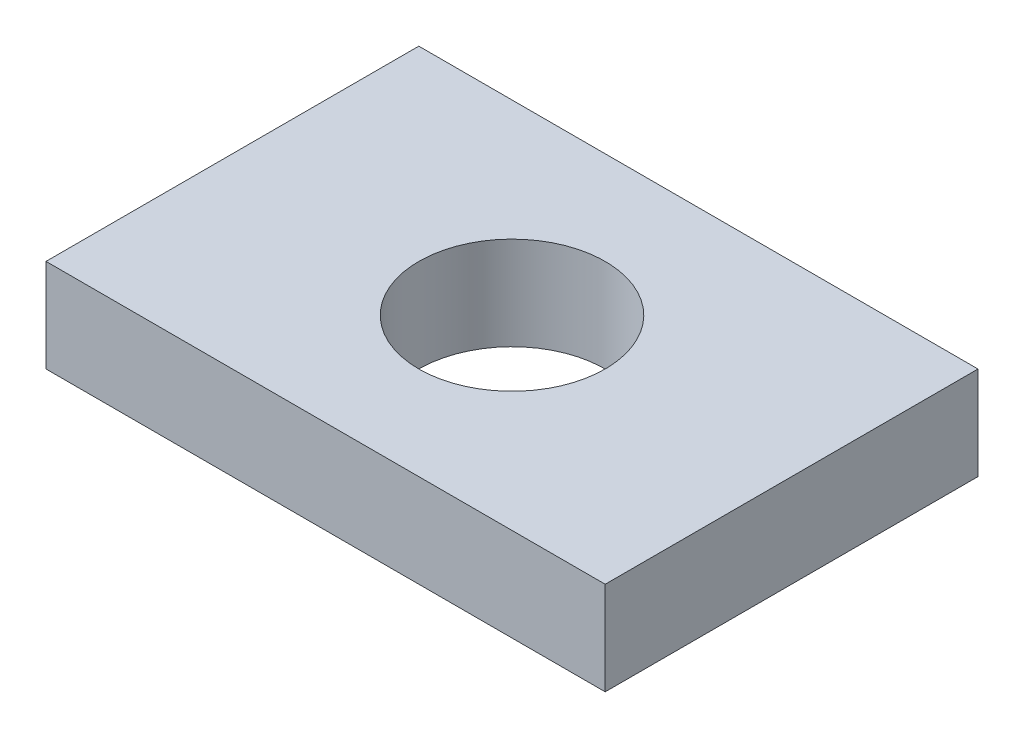
ISO-10303-21;
HEADER;
FILE_DESCRIPTION(('STEP AP214'),'2;1');
FILE_NAME('part.step','',(''),(''),'','','');
FILE_SCHEMA(('AUTOMOTIVE_DESIGN { 1 0 10303 214 1 1 1 1 }'));
ENDSEC;
DATA;
#1=APPLICATION_CONTEXT('core data for automotive mechanical design processes');
#2=APPLICATION_PROTOCOL_DEFINITION('international standard','automotive_design',2000,#1);
#3=PRODUCT_CONTEXT('',#1,'mechanical');
#4=PRODUCT('Part','Part','',(#3));
#5=PRODUCT_RELATED_PRODUCT_CATEGORY('part','',(#4));
#6=PRODUCT_DEFINITION_FORMATION('','',#4);
#7=PRODUCT_DEFINITION_CONTEXT('part definition',#1,'design');
#8=PRODUCT_DEFINITION('design','',#6,#7);
#9=PRODUCT_DEFINITION_SHAPE('','',#8);
#10=(LENGTH_UNIT() NAMED_UNIT(*) SI_UNIT(.MILLI.,.METRE.));
#11=(NAMED_UNIT(*) PLANE_ANGLE_UNIT() SI_UNIT($,.RADIAN.));
#12=(NAMED_UNIT(*) SI_UNIT($,.STERADIAN.) SOLID_ANGLE_UNIT());
#13=UNCERTAINTY_MEASURE_WITH_UNIT(LENGTH_MEASURE(1.E-05),#10,'distance_accuracy_value','');
#14=(GEOMETRIC_REPRESENTATION_CONTEXT(3) GLOBAL_UNCERTAINTY_ASSIGNED_CONTEXT((#13)) GLOBAL_UNIT_ASSIGNED_CONTEXT((#10,
#11,#12)) REPRESENTATION_CONTEXT('',''));
#15=CARTESIAN_POINT('',(0.,0.,0.));
#16=DIRECTION('',(0.,0.,1.));
#17=DIRECTION('',(1.,0.,0.));
#18=AXIS2_PLACEMENT_3D('',#15,#16,#17);
#19=CARTESIAN_POINT('',(0.,6.35,0.));
#20=DIRECTION('',(0.,-1.,0.));
#21=DIRECTION('',(0.,0.,-1.));
#22=AXIS2_PLACEMENT_3D('',#19,#20,#21);
#23=PLANE('',#22);
#24=DIRECTION('',(0.,0.,1.));
#25=VECTOR('',#24,1.);
#26=CARTESIAN_POINT('',(0.,6.35,0.));
#27=LINE('',#26,#25);
#28=CARTESIAN_POINT('',(0.,6.35,-25.4));
#29=VERTEX_POINT('',#28);
#30=CARTESIAN_POINT('',(0.,6.35,0.));
#31=VERTEX_POINT('',#30);
#32=EDGE_CURVE('E89',#29,#31,#27,.T.);
#33=ORIENTED_EDGE('',*,*,#32,.T.);
#34=DIRECTION('',(1.,0.,0.));
#35=VECTOR('',#34,1.);
#36=CARTESIAN_POINT('',(0.,6.35,0.));
#37=LINE('',#36,#35);
#38=CARTESIAN_POINT('',(38.1,6.35,0.));
#39=VERTEX_POINT('',#38);
#40=EDGE_CURVE('E84',#31,#39,#37,.T.);
#41=ORIENTED_EDGE('',*,*,#40,.T.);
#42=DIRECTION('',(0.,0.,-1.));
#43=VECTOR('',#42,1.);
#44=CARTESIAN_POINT('',(38.1,6.35,0.));
#45=LINE('',#44,#43);
#46=CARTESIAN_POINT('',(38.1,6.35,-25.4));
#47=VERTEX_POINT('',#46);
#48=EDGE_CURVE('E87',#39,#47,#45,.T.);
#49=ORIENTED_EDGE('',*,*,#48,.T.);
#50=DIRECTION('',(-1.,0.,0.));
#51=VECTOR('',#50,1.);
#52=CARTESIAN_POINT('',(0.,6.35,-25.4));
#53=LINE('',#52,#51);
#54=EDGE_CURVE('E54',#47,#29,#53,.T.);
#55=ORIENTED_EDGE('',*,*,#54,.T.);
#56=EDGE_LOOP('',(#33,#41,#49,#55));
#57=FACE_BOUND('',#56,.T.);
#58=CARTESIAN_POINT('',(19.05,6.35,-12.7));
#59=DIRECTION('',(0.,1.,0.));
#60=DIRECTION('',(0.,0.,1.));
#61=AXIS2_PLACEMENT_3D('',#58,#59,#60);
#62=CIRCLE('',#61,6.35);
#63=CARTESIAN_POINT('',(19.05,6.35,-6.35));
#64=VERTEX_POINT('',#63);
#65=EDGE_CURVE('E104',#64,#64,#62,.T.);
#66=ORIENTED_EDGE('',*,*,#65,.F.);
#67=EDGE_LOOP('',(#66));
#68=FACE_BOUND('',#67,.T.);
#69=ADVANCED_FACE('F37',(#57,#68),#23,.F.);
#70=CARTESIAN_POINT('',(0.,0.,0.));
#71=DIRECTION('',(0.,-1.,0.));
#72=DIRECTION('',(0.,0.,-1.));
#73=AXIS2_PLACEMENT_3D('',#70,#71,#72);
#74=PLANE('',#73);
#75=DIRECTION('',(0.,0.,1.));
#76=VECTOR('',#75,1.);
#77=CARTESIAN_POINT('',(0.,0.,0.));
#78=LINE('',#77,#76);
#79=CARTESIAN_POINT('',(0.,0.,-25.4));
#80=VERTEX_POINT('',#79);
#81=CARTESIAN_POINT('',(0.,0.,0.));
#82=VERTEX_POINT('',#81);
#83=EDGE_CURVE('E101',#80,#82,#78,.T.);
#84=ORIENTED_EDGE('',*,*,#83,.F.);
#85=DIRECTION('',(-1.,0.,0.));
#86=VECTOR('',#85,1.);
#87=CARTESIAN_POINT('',(0.,0.,-25.4));
#88=LINE('',#87,#86);
#89=CARTESIAN_POINT('',(38.1,0.,-25.4));
#90=VERTEX_POINT('',#89);
#91=EDGE_CURVE('E77',#90,#80,#88,.T.);
#92=ORIENTED_EDGE('',*,*,#91,.F.);
#93=DIRECTION('',(0.,0.,-1.));
#94=VECTOR('',#93,1.);
#95=CARTESIAN_POINT('',(38.1,0.,0.));
#96=LINE('',#95,#94);
#97=CARTESIAN_POINT('',(38.1,0.,0.));
#98=VERTEX_POINT('',#97);
#99=EDGE_CURVE('E71',#98,#90,#96,.T.);
#100=ORIENTED_EDGE('',*,*,#99,.F.);
#101=DIRECTION('',(1.,0.,0.));
#102=VECTOR('',#101,1.);
#103=CARTESIAN_POINT('',(0.,0.,0.));
#104=LINE('',#103,#102);
#105=EDGE_CURVE('E93',#82,#98,#104,.T.);
#106=ORIENTED_EDGE('',*,*,#105,.F.);
#107=EDGE_LOOP('',(#84,#92,#100,#106));
#108=FACE_BOUND('',#107,.T.);
#109=CARTESIAN_POINT('',(19.05,0.,-12.7));
#110=DIRECTION('',(0.,1.,0.));
#111=DIRECTION('',(0.,0.,1.));
#112=AXIS2_PLACEMENT_3D('',#109,#110,#111);
#113=CIRCLE('',#112,6.35);
#114=CARTESIAN_POINT('',(19.05,0.,-6.35));
#115=VERTEX_POINT('',#114);
#116=EDGE_CURVE('E116',#115,#115,#113,.T.);
#117=ORIENTED_EDGE('',*,*,#116,.T.);
#118=EDGE_LOOP('',(#117));
#119=FACE_BOUND('',#118,.T.);
#120=ADVANCED_FACE('F112',(#108,#119),#74,.T.);
#121=CARTESIAN_POINT('',(0.,6.35,0.));
#122=DIRECTION('',(1.,0.,0.));
#123=DIRECTION('',(0.,0.,-1.));
#124=AXIS2_PLACEMENT_3D('',#121,#122,#123);
#125=PLANE('',#124);
#126=ORIENTED_EDGE('',*,*,#83,.T.);
#127=DIRECTION('',(0.,-1.,0.));
#128=VECTOR('',#127,1.);
#129=CARTESIAN_POINT('',(0.,6.35,0.));
#130=LINE('',#129,#128);
#131=EDGE_CURVE('E11',#31,#82,#130,.T.);
#132=ORIENTED_EDGE('',*,*,#131,.F.);
#133=ORIENTED_EDGE('',*,*,#32,.F.);
#134=DIRECTION('',(0.,-1.,0.));
#135=VECTOR('',#134,1.);
#136=CARTESIAN_POINT('',(0.,6.35,-25.4));
#137=LINE('',#136,#135);
#138=EDGE_CURVE('E97',#29,#80,#137,.T.);
#139=ORIENTED_EDGE('',*,*,#138,.T.);
#140=EDGE_LOOP('',(#126,#132,#133,#139));
#141=FACE_BOUND('',#140,.T.);
#142=ADVANCED_FACE('F39',(#141),#125,.F.);
#143=CARTESIAN_POINT('',(0.,6.35,0.));
#144=DIRECTION('',(0.,0.,-1.));
#145=DIRECTION('',(-1.,0.,0.));
#146=AXIS2_PLACEMENT_3D('',#143,#144,#145);
#147=PLANE('',#146);
#148=ORIENTED_EDGE('',*,*,#105,.T.);
#149=DIRECTION('',(0.,-1.,0.));
#150=VECTOR('',#149,1.);
#151=CARTESIAN_POINT('',(38.1,6.35,0.));
#152=LINE('',#151,#150);
#153=EDGE_CURVE('E46',#39,#98,#152,.T.);
#154=ORIENTED_EDGE('',*,*,#153,.F.);
#155=ORIENTED_EDGE('',*,*,#40,.F.);
#156=ORIENTED_EDGE('',*,*,#131,.T.);
#157=EDGE_LOOP('',(#148,#154,#155,#156));
#158=FACE_BOUND('',#157,.T.);
#159=ADVANCED_FACE('F92',(#158),#147,.F.);
#160=CARTESIAN_POINT('',(38.1,6.35,0.));
#161=DIRECTION('',(-1.,0.,0.));
#162=DIRECTION('',(0.,0.,1.));
#163=AXIS2_PLACEMENT_3D('',#160,#161,#162);
#164=PLANE('',#163);
#165=ORIENTED_EDGE('',*,*,#99,.T.);
#166=DIRECTION('',(0.,-1.,0.));
#167=VECTOR('',#166,1.);
#168=CARTESIAN_POINT('',(38.1,6.35,-25.4));
#169=LINE('',#168,#167);
#170=EDGE_CURVE('E94',#47,#90,#169,.T.);
#171=ORIENTED_EDGE('',*,*,#170,.F.);
#172=ORIENTED_EDGE('',*,*,#48,.F.);
#173=ORIENTED_EDGE('',*,*,#153,.T.);
#174=EDGE_LOOP('',(#165,#171,#172,#173));
#175=FACE_BOUND('',#174,.T.);
#176=ADVANCED_FACE('F95',(#175),#164,.F.);
#177=CARTESIAN_POINT('',(0.,6.35,-25.4));
#178=DIRECTION('',(0.,0.,1.));
#179=DIRECTION('',(1.,0.,0.));
#180=AXIS2_PLACEMENT_3D('',#177,#178,#179);
#181=PLANE('',#180);
#182=ORIENTED_EDGE('',*,*,#91,.T.);
#183=ORIENTED_EDGE('',*,*,#138,.F.);
#184=ORIENTED_EDGE('',*,*,#54,.F.);
#185=ORIENTED_EDGE('',*,*,#170,.T.);
#186=EDGE_LOOP('',(#182,#183,#184,#185));
#187=FACE_BOUND('',#186,.T.);
#188=ADVANCED_FACE('F109',(#187),#181,.F.);
#189=CARTESIAN_POINT('',(19.05,6.35,-12.7));
#190=DIRECTION('',(0.,-1.,0.));
#191=DIRECTION('',(0.,0.,-1.));
#192=AXIS2_PLACEMENT_3D('',#189,#190,#191);
#193=CYLINDRICAL_SURFACE('',#192,6.35);
#194=ORIENTED_EDGE('',*,*,#65,.T.);
#195=EDGE_LOOP('',(#194));
#196=FACE_BOUND('',#195,.T.);
#197=ORIENTED_EDGE('',*,*,#116,.F.);
#198=EDGE_LOOP('',(#197));
#199=FACE_BOUND('',#198,.T.);
#200=ADVANCED_FACE('F122',(#196,#199),#193,.F.);
#201=CLOSED_SHELL('',(#69,#120,#142,#159,#176,#188,#200));
#202=MANIFOLD_SOLID_BREP('B2',#201);
#203=ADVANCED_BREP_SHAPE_REPRESENTATION('',(#18,#202),#14);
#204=SHAPE_DEFINITION_REPRESENTATION(#9,#203);
ENDSEC;
END-ISO-10303-21;
